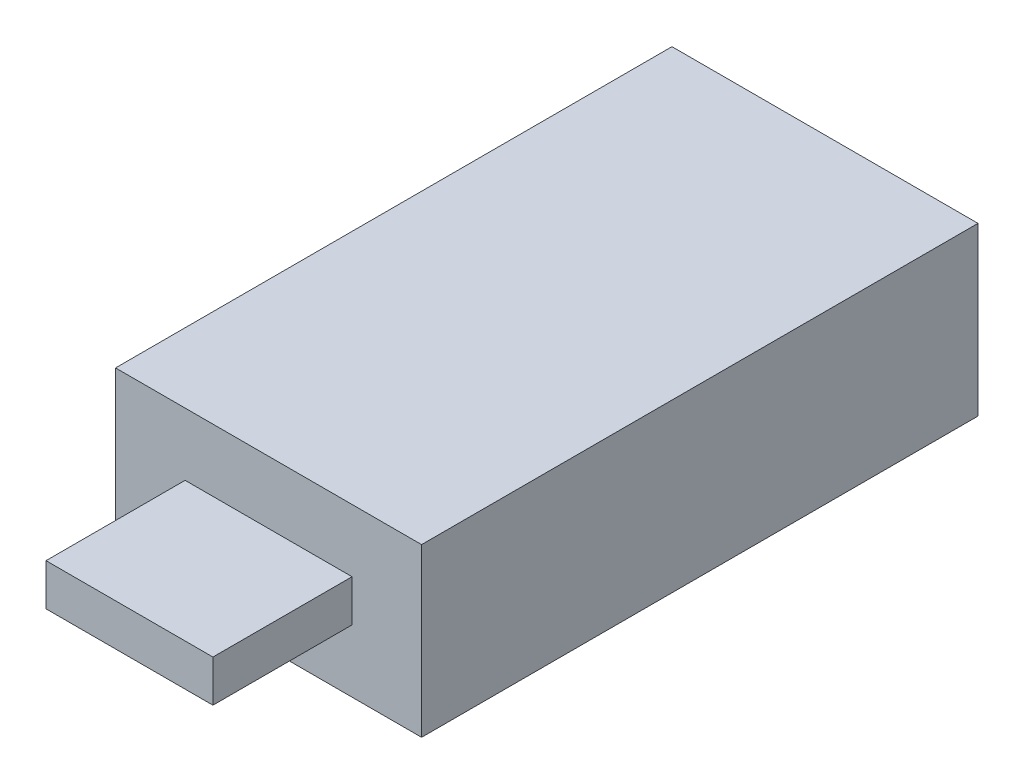
ISO-10303-21;
HEADER;
FILE_DESCRIPTION(('STEP AP214'),'2;1');
FILE_NAME('part.step','',(''),(''),'','','');
FILE_SCHEMA(('AUTOMOTIVE_DESIGN { 1 0 10303 214 1 1 1 1 }'));
ENDSEC;
DATA;
#1=APPLICATION_CONTEXT('core data for automotive mechanical design processes');
#2=APPLICATION_PROTOCOL_DEFINITION('international standard','automotive_design',2000,#1);
#3=PRODUCT_CONTEXT('',#1,'mechanical');
#4=PRODUCT('Part','Part','',(#3));
#5=PRODUCT_RELATED_PRODUCT_CATEGORY('part','',(#4));
#6=PRODUCT_DEFINITION_FORMATION('','',#4);
#7=PRODUCT_DEFINITION_CONTEXT('part definition',#1,'design');
#8=PRODUCT_DEFINITION('design','',#6,#7);
#9=PRODUCT_DEFINITION_SHAPE('','',#8);
#10=(LENGTH_UNIT() NAMED_UNIT(*) SI_UNIT(.MILLI.,.METRE.));
#11=(NAMED_UNIT(*) PLANE_ANGLE_UNIT() SI_UNIT($,.RADIAN.));
#12=(NAMED_UNIT(*) SI_UNIT($,.STERADIAN.) SOLID_ANGLE_UNIT());
#13=UNCERTAINTY_MEASURE_WITH_UNIT(LENGTH_MEASURE(1.E-05),#10,'distance_accuracy_value','');
#14=(GEOMETRIC_REPRESENTATION_CONTEXT(3) GLOBAL_UNCERTAINTY_ASSIGNED_CONTEXT((#13)) GLOBAL_UNIT_ASSIGNED_CONTEXT((#10,
#11,#12)) REPRESENTATION_CONTEXT('',''));
#15=CARTESIAN_POINT('',(0.,0.,0.));
#16=DIRECTION('',(0.,0.,1.));
#17=DIRECTION('',(1.,0.,0.));
#18=AXIS2_PLACEMENT_3D('',#15,#16,#17);
#19=CARTESIAN_POINT('',(11.,6.,40.));
#20=DIRECTION('',(-1.,0.,0.));
#21=DIRECTION('',(0.,-1.,0.));
#22=AXIS2_PLACEMENT_3D('',#19,#20,#21);
#23=PLANE('',#22);
#24=DIRECTION('',(0.,1.,0.));
#25=VECTOR('',#24,1.);
#26=CARTESIAN_POINT('',(11.,6.,0.));
#27=LINE('',#26,#25);
#28=CARTESIAN_POINT('',(11.,-6.,0.));
#29=VERTEX_POINT('',#28);
#30=CARTESIAN_POINT('',(11.,6.,0.));
#31=VERTEX_POINT('',#30);
#32=EDGE_CURVE('E116',#29,#31,#27,.T.);
#33=ORIENTED_EDGE('',*,*,#32,.T.);
#34=DIRECTION('',(0.,0.,-1.));
#35=VECTOR('',#34,1.);
#36=CARTESIAN_POINT('',(11.,6.,40.));
#37=LINE('',#36,#35);
#38=CARTESIAN_POINT('',(11.,6.,40.));
#39=VERTEX_POINT('',#38);
#40=EDGE_CURVE('E11',#39,#31,#37,.T.);
#41=ORIENTED_EDGE('',*,*,#40,.F.);
#42=DIRECTION('',(0.,1.,0.));
#43=VECTOR('',#42,1.);
#44=CARTESIAN_POINT('',(11.,6.,40.));
#45=LINE('',#44,#43);
#46=CARTESIAN_POINT('',(11.,-6.,40.));
#47=VERTEX_POINT('',#46);
#48=EDGE_CURVE('E125',#47,#39,#45,.T.);
#49=ORIENTED_EDGE('',*,*,#48,.F.);
#50=DIRECTION('',(0.,0.,-1.));
#51=VECTOR('',#50,1.);
#52=CARTESIAN_POINT('',(11.,-6.,40.));
#53=LINE('',#52,#51);
#54=EDGE_CURVE('E134',#47,#29,#53,.T.);
#55=ORIENTED_EDGE('',*,*,#54,.T.);
#56=EDGE_LOOP('',(#33,#41,#49,#55));
#57=FACE_BOUND('',#56,.T.);
#58=ADVANCED_FACE('F32',(#57),#23,.F.);
#59=CARTESIAN_POINT('',(-11.,6.,40.));
#60=DIRECTION('',(0.,-1.,0.));
#61=DIRECTION('',(0.,0.,-1.));
#62=AXIS2_PLACEMENT_3D('',#59,#60,#61);
#63=PLANE('',#62);
#64=DIRECTION('',(-1.,0.,0.));
#65=VECTOR('',#64,1.);
#66=CARTESIAN_POINT('',(-11.,6.,0.));
#67=LINE('',#66,#65);
#68=CARTESIAN_POINT('',(-11.,6.,0.));
#69=VERTEX_POINT('',#68);
#70=EDGE_CURVE('E119',#31,#69,#67,.T.);
#71=ORIENTED_EDGE('',*,*,#70,.T.);
#72=DIRECTION('',(0.,0.,-1.));
#73=VECTOR('',#72,1.);
#74=CARTESIAN_POINT('',(-11.,6.,40.));
#75=LINE('',#74,#73);
#76=CARTESIAN_POINT('',(-11.,6.,40.));
#77=VERTEX_POINT('',#76);
#78=EDGE_CURVE('E39',#77,#69,#75,.T.);
#79=ORIENTED_EDGE('',*,*,#78,.F.);
#80=DIRECTION('',(-1.,0.,0.));
#81=VECTOR('',#80,1.);
#82=CARTESIAN_POINT('',(-11.,6.,40.));
#83=LINE('',#82,#81);
#84=EDGE_CURVE('E128',#39,#77,#83,.T.);
#85=ORIENTED_EDGE('',*,*,#84,.F.);
#86=ORIENTED_EDGE('',*,*,#40,.T.);
#87=EDGE_LOOP('',(#71,#79,#85,#86));
#88=FACE_BOUND('',#87,.T.);
#89=ADVANCED_FACE('F165',(#88),#63,.F.);
#90=CARTESIAN_POINT('',(-11.,6.,40.));
#91=DIRECTION('',(1.,0.,0.));
#92=DIRECTION('',(0.,1.,0.));
#93=AXIS2_PLACEMENT_3D('',#90,#91,#92);
#94=PLANE('',#93);
#95=DIRECTION('',(0.,-1.,0.));
#96=VECTOR('',#95,1.);
#97=CARTESIAN_POINT('',(-11.,6.,0.));
#98=LINE('',#97,#96);
#99=CARTESIAN_POINT('',(-11.,-6.,0.));
#100=VERTEX_POINT('',#99);
#101=EDGE_CURVE('E137',#69,#100,#98,.T.);
#102=ORIENTED_EDGE('',*,*,#101,.T.);
#103=DIRECTION('',(0.,0.,-1.));
#104=VECTOR('',#103,1.);
#105=CARTESIAN_POINT('',(-11.,-6.,40.));
#106=LINE('',#105,#104);
#107=CARTESIAN_POINT('',(-11.,-6.,40.));
#108=VERTEX_POINT('',#107);
#109=EDGE_CURVE('E142',#108,#100,#106,.T.);
#110=ORIENTED_EDGE('',*,*,#109,.F.);
#111=DIRECTION('',(0.,-1.,0.));
#112=VECTOR('',#111,1.);
#113=CARTESIAN_POINT('',(-11.,6.,40.));
#114=LINE('',#113,#112);
#115=EDGE_CURVE('E131',#77,#108,#114,.T.);
#116=ORIENTED_EDGE('',*,*,#115,.F.);
#117=ORIENTED_EDGE('',*,*,#78,.T.);
#118=EDGE_LOOP('',(#102,#110,#116,#117));
#119=FACE_BOUND('',#118,.T.);
#120=ADVANCED_FACE('F149',(#119),#94,.F.);
#121=CARTESIAN_POINT('',(-11.,-6.,40.));
#122=DIRECTION('',(0.,1.,0.));
#123=DIRECTION('',(0.,0.,1.));
#124=AXIS2_PLACEMENT_3D('',#121,#122,#123);
#125=PLANE('',#124);
#126=DIRECTION('',(1.,0.,0.));
#127=VECTOR('',#126,1.);
#128=CARTESIAN_POINT('',(-11.,-6.,0.));
#129=LINE('',#128,#127);
#130=EDGE_CURVE('E129',#100,#29,#129,.T.);
#131=ORIENTED_EDGE('',*,*,#130,.T.);
#132=ORIENTED_EDGE('',*,*,#54,.F.);
#133=DIRECTION('',(1.,0.,0.));
#134=VECTOR('',#133,1.);
#135=CARTESIAN_POINT('',(-11.,-6.,40.));
#136=LINE('',#135,#134);
#137=EDGE_CURVE('E133',#108,#47,#136,.T.);
#138=ORIENTED_EDGE('',*,*,#137,.F.);
#139=ORIENTED_EDGE('',*,*,#109,.T.);
#140=EDGE_LOOP('',(#131,#132,#138,#139));
#141=FACE_BOUND('',#140,.T.);
#142=ADVANCED_FACE('F158',(#141),#125,.F.);
#143=CARTESIAN_POINT('',(0.,0.,40.));
#144=DIRECTION('',(0.,0.,1.));
#145=DIRECTION('',(1.,0.,0.));
#146=AXIS2_PLACEMENT_3D('',#143,#144,#145);
#147=PLANE('',#146);
#148=DIRECTION('',(0.,1.,0.));
#149=VECTOR('',#148,1.);
#150=CARTESIAN_POINT('',(6.,1.5,40.));
#151=LINE('',#150,#149);
#152=CARTESIAN_POINT('',(6.,-1.5,40.));
#153=VERTEX_POINT('',#152);
#154=CARTESIAN_POINT('',(6.,1.5,40.));
#155=VERTEX_POINT('',#154);
#156=EDGE_CURVE('E46',#153,#155,#151,.T.);
#157=ORIENTED_EDGE('',*,*,#156,.F.);
#158=DIRECTION('',(1.,0.,0.));
#159=VECTOR('',#158,1.);
#160=CARTESIAN_POINT('',(-6.,-1.5,40.));
#161=LINE('',#160,#159);
#162=CARTESIAN_POINT('',(-6.,-1.5,40.));
#163=VERTEX_POINT('',#162);
#164=EDGE_CURVE('E50',#163,#153,#161,.T.);
#165=ORIENTED_EDGE('',*,*,#164,.F.);
#166=DIRECTION('',(0.,-1.,0.));
#167=VECTOR('',#166,1.);
#168=CARTESIAN_POINT('',(-6.,1.5,40.));
#169=LINE('',#168,#167);
#170=CARTESIAN_POINT('',(-6.,1.5,40.));
#171=VERTEX_POINT('',#170);
#172=EDGE_CURVE('E259',#171,#163,#169,.T.);
#173=ORIENTED_EDGE('',*,*,#172,.F.);
#174=DIRECTION('',(-1.,0.,0.));
#175=VECTOR('',#174,1.);
#176=CARTESIAN_POINT('',(-6.,1.5,40.));
#177=LINE('',#176,#175);
#178=EDGE_CURVE('E265',#155,#171,#177,.T.);
#179=ORIENTED_EDGE('',*,*,#178,.F.);
#180=EDGE_LOOP('',(#157,#165,#173,#179));
#181=FACE_BOUND('',#180,.T.);
#182=ORIENTED_EDGE('',*,*,#48,.T.);
#183=ORIENTED_EDGE('',*,*,#84,.T.);
#184=ORIENTED_EDGE('',*,*,#115,.T.);
#185=ORIENTED_EDGE('',*,*,#137,.T.);
#186=EDGE_LOOP('',(#182,#183,#184,#185));
#187=FACE_BOUND('',#186,.T.);
#188=ADVANCED_FACE('F164',(#181,#187),#147,.T.);
#189=CARTESIAN_POINT('',(0.,0.,0.));
#190=DIRECTION('',(0.,0.,1.));
#191=DIRECTION('',(1.,0.,0.));
#192=AXIS2_PLACEMENT_3D('',#189,#190,#191);
#193=PLANE('',#192);
#194=ORIENTED_EDGE('',*,*,#32,.F.);
#195=ORIENTED_EDGE('',*,*,#130,.F.);
#196=ORIENTED_EDGE('',*,*,#101,.F.);
#197=ORIENTED_EDGE('',*,*,#70,.F.);
#198=EDGE_LOOP('',(#194,#195,#196,#197));
#199=FACE_BOUND('',#198,.T.);
#200=ADVANCED_FACE('F155',(#199),#193,.F.);
#201=CARTESIAN_POINT('',(6.,1.5,50.));
#202=DIRECTION('',(-1.,0.,0.));
#203=DIRECTION('',(0.,-1.,0.));
#204=AXIS2_PLACEMENT_3D('',#201,#202,#203);
#205=PLANE('',#204);
#206=ORIENTED_EDGE('',*,*,#156,.T.);
#207=DIRECTION('',(0.,0.,-1.));
#208=VECTOR('',#207,1.);
#209=CARTESIAN_POINT('',(6.,1.5,50.));
#210=LINE('',#209,#208);
#211=CARTESIAN_POINT('',(6.,1.5,50.));
#212=VERTEX_POINT('',#211);
#213=EDGE_CURVE('E99',#212,#155,#210,.T.);
#214=ORIENTED_EDGE('',*,*,#213,.F.);
#215=DIRECTION('',(0.,1.,0.));
#216=VECTOR('',#215,1.);
#217=CARTESIAN_POINT('',(6.,1.5,50.));
#218=LINE('',#217,#216);
#219=CARTESIAN_POINT('',(6.,-1.5,50.));
#220=VERTEX_POINT('',#219);
#221=EDGE_CURVE('E105',#220,#212,#218,.T.);
#222=ORIENTED_EDGE('',*,*,#221,.F.);
#223=DIRECTION('',(0.,0.,-1.));
#224=VECTOR('',#223,1.);
#225=CARTESIAN_POINT('',(6.,-1.5,50.));
#226=LINE('',#225,#224);
#227=EDGE_CURVE('E257',#220,#153,#226,.T.);
#228=ORIENTED_EDGE('',*,*,#227,.T.);
#229=EDGE_LOOP('',(#206,#214,#222,#228));
#230=FACE_BOUND('',#229,.T.);
#231=ADVANCED_FACE('F115',(#230),#205,.F.);
#232=CARTESIAN_POINT('',(-6.,1.5,50.));
#233=DIRECTION('',(0.,-1.,0.));
#234=DIRECTION('',(0.,0.,-1.));
#235=AXIS2_PLACEMENT_3D('',#232,#233,#234);
#236=PLANE('',#235);
#237=ORIENTED_EDGE('',*,*,#178,.T.);
#238=DIRECTION('',(0.,0.,-1.));
#239=VECTOR('',#238,1.);
#240=CARTESIAN_POINT('',(-6.,1.5,50.));
#241=LINE('',#240,#239);
#242=CARTESIAN_POINT('',(-6.,1.5,50.));
#243=VERTEX_POINT('',#242);
#244=EDGE_CURVE('E101',#243,#171,#241,.T.);
#245=ORIENTED_EDGE('',*,*,#244,.F.);
#246=DIRECTION('',(-1.,0.,0.));
#247=VECTOR('',#246,1.);
#248=CARTESIAN_POINT('',(-6.,1.5,50.));
#249=LINE('',#248,#247);
#250=EDGE_CURVE('E94',#212,#243,#249,.T.);
#251=ORIENTED_EDGE('',*,*,#250,.F.);
#252=ORIENTED_EDGE('',*,*,#213,.T.);
#253=EDGE_LOOP('',(#237,#245,#251,#252));
#254=FACE_BOUND('',#253,.T.);
#255=ADVANCED_FACE('F97',(#254),#236,.F.);
#256=CARTESIAN_POINT('',(-6.,1.5,50.));
#257=DIRECTION('',(1.,0.,0.));
#258=DIRECTION('',(0.,0.,-1.));
#259=AXIS2_PLACEMENT_3D('',#256,#257,#258);
#260=PLANE('',#259);
#261=ORIENTED_EDGE('',*,*,#172,.T.);
#262=DIRECTION('',(0.,0.,-1.));
#263=VECTOR('',#262,1.);
#264=CARTESIAN_POINT('',(-6.,-1.5,50.));
#265=LINE('',#264,#263);
#266=CARTESIAN_POINT('',(-6.,-1.5,50.));
#267=VERTEX_POINT('',#266);
#268=EDGE_CURVE('E121',#267,#163,#265,.T.);
#269=ORIENTED_EDGE('',*,*,#268,.F.);
#270=DIRECTION('',(0.,-1.,0.));
#271=VECTOR('',#270,1.);
#272=CARTESIAN_POINT('',(-6.,1.5,50.));
#273=LINE('',#272,#271);
#274=EDGE_CURVE('E104',#243,#267,#273,.T.);
#275=ORIENTED_EDGE('',*,*,#274,.F.);
#276=ORIENTED_EDGE('',*,*,#244,.T.);
#277=EDGE_LOOP('',(#261,#269,#275,#276));
#278=FACE_BOUND('',#277,.T.);
#279=ADVANCED_FACE('F183',(#278),#260,.F.);
#280=CARTESIAN_POINT('',(-6.,-1.5,50.));
#281=DIRECTION('',(0.,1.,0.));
#282=DIRECTION('',(0.,0.,1.));
#283=AXIS2_PLACEMENT_3D('',#280,#281,#282);
#284=PLANE('',#283);
#285=ORIENTED_EDGE('',*,*,#164,.T.);
#286=ORIENTED_EDGE('',*,*,#227,.F.);
#287=DIRECTION('',(1.,0.,0.));
#288=VECTOR('',#287,1.);
#289=CARTESIAN_POINT('',(-6.,-1.5,50.));
#290=LINE('',#289,#288);
#291=EDGE_CURVE('E110',#267,#220,#290,.T.);
#292=ORIENTED_EDGE('',*,*,#291,.F.);
#293=ORIENTED_EDGE('',*,*,#268,.T.);
#294=EDGE_LOOP('',(#285,#286,#292,#293));
#295=FACE_BOUND('',#294,.T.);
#296=ADVANCED_FACE('F186',(#295),#284,.F.);
#297=CARTESIAN_POINT('',(0.,0.,50.));
#298=DIRECTION('',(0.,0.,1.));
#299=DIRECTION('',(1.,0.,0.));
#300=AXIS2_PLACEMENT_3D('',#297,#298,#299);
#301=PLANE('',#300);
#302=ORIENTED_EDGE('',*,*,#221,.T.);
#303=ORIENTED_EDGE('',*,*,#250,.T.);
#304=ORIENTED_EDGE('',*,*,#274,.T.);
#305=ORIENTED_EDGE('',*,*,#291,.T.);
#306=EDGE_LOOP('',(#302,#303,#304,#305));
#307=FACE_BOUND('',#306,.T.);
#308=ADVANCED_FACE('F108',(#307),#301,.T.);
#309=CLOSED_SHELL('',(#58,#89,#120,#142,#188,#200,#231,#255,#279,#296,#308));
#310=MANIFOLD_SOLID_BREP('B2',#309);
#311=ADVANCED_BREP_SHAPE_REPRESENTATION('',(#18,#310),#14);
#312=SHAPE_DEFINITION_REPRESENTATION(#9,#311);
ENDSEC;
END-ISO-10303-21;
